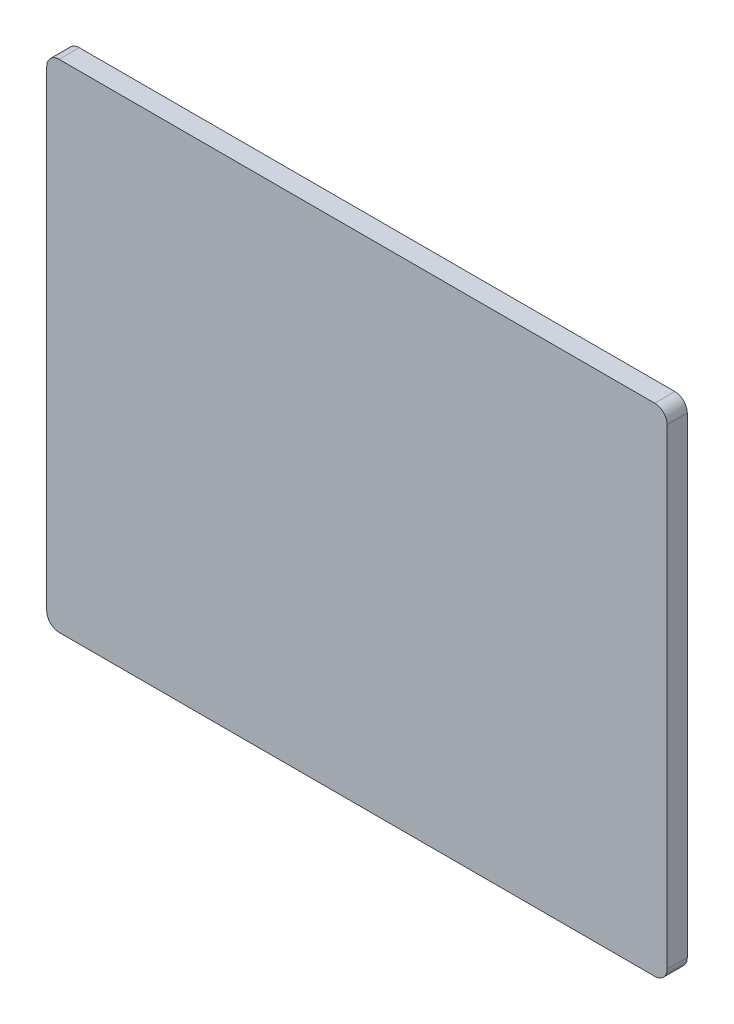
ISO-10303-21;
HEADER;
FILE_DESCRIPTION(('STEP AP214'),'2;1');
FILE_NAME('part.step','',(''),(''),'','','');
FILE_SCHEMA(('AUTOMOTIVE_DESIGN { 1 0 10303 214 1 1 1 1 }'));
ENDSEC;
DATA;
#1=APPLICATION_CONTEXT('core data for automotive mechanical design processes');
#2=APPLICATION_PROTOCOL_DEFINITION('international standard','automotive_design',2000,#1);
#3=PRODUCT_CONTEXT('',#1,'mechanical');
#4=PRODUCT('Part','Part','',(#3));
#5=PRODUCT_RELATED_PRODUCT_CATEGORY('part','',(#4));
#6=PRODUCT_DEFINITION_FORMATION('','',#4);
#7=PRODUCT_DEFINITION_CONTEXT('part definition',#1,'design');
#8=PRODUCT_DEFINITION('design','',#6,#7);
#9=PRODUCT_DEFINITION_SHAPE('','',#8);
#10=(LENGTH_UNIT() NAMED_UNIT(*) SI_UNIT(.MILLI.,.METRE.));
#11=(NAMED_UNIT(*) PLANE_ANGLE_UNIT() SI_UNIT($,.RADIAN.));
#12=(NAMED_UNIT(*) SI_UNIT($,.STERADIAN.) SOLID_ANGLE_UNIT());
#13=UNCERTAINTY_MEASURE_WITH_UNIT(LENGTH_MEASURE(1.E-05),#10,'distance_accuracy_value','');
#14=(GEOMETRIC_REPRESENTATION_CONTEXT(3) GLOBAL_UNCERTAINTY_ASSIGNED_CONTEXT((#13)) GLOBAL_UNIT_ASSIGNED_CONTEXT((#10,
#11,#12)) REPRESENTATION_CONTEXT('',''));
#15=CARTESIAN_POINT('',(0.,0.,0.));
#16=DIRECTION('',(0.,0.,1.));
#17=DIRECTION('',(1.,0.,0.));
#18=AXIS2_PLACEMENT_3D('',#15,#16,#17);
#19=CARTESIAN_POINT('',(0.,76.7324314895927,0.));
#20=DIRECTION('',(0.,-1.,0.));
#21=DIRECTION('',(0.,0.,-1.));
#22=AXIS2_PLACEMENT_3D('',#19,#20,#21);
#23=PLANE('',#22);
#24=DIRECTION('',(1.,0.,0.));
#25=VECTOR('',#24,1.);
#26=CARTESIAN_POINT('',(0.,76.7324314895927,13.));
#27=LINE('',#26,#25);
#28=CARTESIAN_POINT('',(-194.722973758673,76.7324314895927,13.));
#29=VERTEX_POINT('',#28);
#30=CARTESIAN_POINT('',(189.277026241327,76.7324314895927,13.));
#31=VERTEX_POINT('',#30);
#32=EDGE_CURVE('E162',#29,#31,#27,.T.);
#33=ORIENTED_EDGE('',*,*,#32,.T.);
#34=DIRECTION('',(0.,0.,1.));
#35=VECTOR('',#34,1.);
#36=CARTESIAN_POINT('',(189.277026241327,76.7324314895927,0.));
#37=LINE('',#36,#35);
#38=CARTESIAN_POINT('',(189.277026241327,76.7324314895927,0.));
#39=VERTEX_POINT('',#38);
#40=EDGE_CURVE('E142',#31,#39,#37,.F.);
#41=ORIENTED_EDGE('',*,*,#40,.T.);
#42=DIRECTION('',(1.,0.,0.));
#43=VECTOR('',#42,1.);
#44=CARTESIAN_POINT('',(0.,76.7324314895927,0.));
#45=LINE('',#44,#43);
#46=CARTESIAN_POINT('',(-194.722973758673,76.7324314895927,0.));
#47=VERTEX_POINT('',#46);
#48=EDGE_CURVE('E123',#47,#39,#45,.T.);
#49=ORIENTED_EDGE('',*,*,#48,.F.);
#50=DIRECTION('',(0.,0.,1.));
#51=VECTOR('',#50,1.);
#52=CARTESIAN_POINT('',(-194.722973758673,76.7324314895927,13.));
#53=LINE('',#52,#51);
#54=EDGE_CURVE('E139',#47,#29,#53,.T.);
#55=ORIENTED_EDGE('',*,*,#54,.T.);
#56=EDGE_LOOP('',(#33,#41,#49,#55));
#57=FACE_BOUND('',#56,.T.);
#58=ADVANCED_FACE('F37',(#57),#23,.F.);
#59=CARTESIAN_POINT('',(197.277026241327,0.,0.));
#60=DIRECTION('',(1.,0.,0.));
#61=DIRECTION('',(0.,1.,0.));
#62=AXIS2_PLACEMENT_3D('',#59,#60,#61);
#63=PLANE('',#62);
#64=DIRECTION('',(0.,1.,0.));
#65=VECTOR('',#64,1.);
#66=CARTESIAN_POINT('',(197.277026241327,0.,0.));
#67=LINE('',#66,#65);
#68=CARTESIAN_POINT('',(197.277026241327,-235.267568510407,0.));
#69=VERTEX_POINT('',#68);
#70=CARTESIAN_POINT('',(197.277026241327,68.7324314895926,0.));
#71=VERTEX_POINT('',#70);
#72=EDGE_CURVE('E127',#69,#71,#67,.T.);
#73=ORIENTED_EDGE('',*,*,#72,.T.);
#74=DIRECTION('',(0.,0.,1.));
#75=VECTOR('',#74,1.);
#76=CARTESIAN_POINT('',(197.277026241327,68.7324314895926,13.));
#77=LINE('',#76,#75);
#78=CARTESIAN_POINT('',(197.277026241327,68.7324314895926,13.));
#79=VERTEX_POINT('',#78);
#80=EDGE_CURVE('E114',#71,#79,#77,.T.);
#81=ORIENTED_EDGE('',*,*,#80,.T.);
#82=DIRECTION('',(0.,1.,0.));
#83=VECTOR('',#82,1.);
#84=CARTESIAN_POINT('',(197.277026241327,0.,13.));
#85=LINE('',#84,#83);
#86=CARTESIAN_POINT('',(197.277026241327,-235.267568510407,13.));
#87=VERTEX_POINT('',#86);
#88=EDGE_CURVE('E106',#87,#79,#85,.T.);
#89=ORIENTED_EDGE('',*,*,#88,.F.);
#90=DIRECTION('',(0.,0.,1.));
#91=VECTOR('',#90,1.);
#92=CARTESIAN_POINT('',(197.277026241327,-235.267568510407,0.));
#93=LINE('',#92,#91);
#94=EDGE_CURVE('E120',#87,#69,#93,.F.);
#95=ORIENTED_EDGE('',*,*,#94,.T.);
#96=EDGE_LOOP('',(#73,#81,#89,#95));
#97=FACE_BOUND('',#96,.T.);
#98=ADVANCED_FACE('F119',(#97),#63,.T.);
#99=CARTESIAN_POINT('',(0.,-243.267568510407,0.));
#100=DIRECTION('',(0.,-1.,0.));
#101=DIRECTION('',(0.,0.,-1.));
#102=AXIS2_PLACEMENT_3D('',#99,#100,#101);
#103=PLANE('',#102);
#104=DIRECTION('',(1.,0.,0.));
#105=VECTOR('',#104,1.);
#106=CARTESIAN_POINT('',(0.,-243.267568510407,13.));
#107=LINE('',#106,#105);
#108=CARTESIAN_POINT('',(-194.722973758673,-243.267568510407,13.));
#109=VERTEX_POINT('',#108);
#110=CARTESIAN_POINT('',(189.277026241327,-243.267568510407,13.));
#111=VERTEX_POINT('',#110);
#112=EDGE_CURVE('E108',#109,#111,#107,.T.);
#113=ORIENTED_EDGE('',*,*,#112,.F.);
#114=DIRECTION('',(0.,0.,1.));
#115=VECTOR('',#114,1.);
#116=CARTESIAN_POINT('',(-194.722973758673,-243.267568510407,0.));
#117=LINE('',#116,#115);
#118=CARTESIAN_POINT('',(-194.722973758673,-243.267568510407,0.));
#119=VERTEX_POINT('',#118);
#120=EDGE_CURVE('E11',#109,#119,#117,.F.);
#121=ORIENTED_EDGE('',*,*,#120,.T.);
#122=DIRECTION('',(1.,0.,0.));
#123=VECTOR('',#122,1.);
#124=CARTESIAN_POINT('',(0.,-243.267568510407,0.));
#125=LINE('',#124,#123);
#126=CARTESIAN_POINT('',(189.277026241327,-243.267568510407,0.));
#127=VERTEX_POINT('',#126);
#128=EDGE_CURVE('E130',#119,#127,#125,.T.);
#129=ORIENTED_EDGE('',*,*,#128,.T.);
#130=DIRECTION('',(0.,0.,1.));
#131=VECTOR('',#130,1.);
#132=CARTESIAN_POINT('',(189.277026241327,-243.267568510407,0.));
#133=LINE('',#132,#131);
#134=EDGE_CURVE('E45',#127,#111,#133,.T.);
#135=ORIENTED_EDGE('',*,*,#134,.T.);
#136=EDGE_LOOP('',(#113,#121,#129,#135));
#137=FACE_BOUND('',#136,.T.);
#138=ADVANCED_FACE('F155',(#137),#103,.T.);
#139=CARTESIAN_POINT('',(-202.722973758673,0.,0.));
#140=DIRECTION('',(-1.,0.,0.));
#141=DIRECTION('',(0.,-1.,0.));
#142=AXIS2_PLACEMENT_3D('',#139,#140,#141);
#143=PLANE('',#142);
#144=DIRECTION('',(0.,-1.,0.));
#145=VECTOR('',#144,1.);
#146=CARTESIAN_POINT('',(-202.722973758673,0.,13.));
#147=LINE('',#146,#145);
#148=CARTESIAN_POINT('',(-202.722973758673,68.7324314895927,13.));
#149=VERTEX_POINT('',#148);
#150=CARTESIAN_POINT('',(-202.722973758673,-235.267568510407,13.));
#151=VERTEX_POINT('',#150);
#152=EDGE_CURVE('E165',#149,#151,#147,.T.);
#153=ORIENTED_EDGE('',*,*,#152,.F.);
#154=DIRECTION('',(0.,0.,1.));
#155=VECTOR('',#154,1.);
#156=CARTESIAN_POINT('',(-202.722973758673,68.7324314895927,0.));
#157=LINE('',#156,#155);
#158=CARTESIAN_POINT('',(-202.722973758673,68.7324314895927,0.));
#159=VERTEX_POINT('',#158);
#160=EDGE_CURVE('E59',#149,#159,#157,.F.);
#161=ORIENTED_EDGE('',*,*,#160,.T.);
#162=DIRECTION('',(0.,-1.,0.));
#163=VECTOR('',#162,1.);
#164=CARTESIAN_POINT('',(-202.722973758673,0.,0.));
#165=LINE('',#164,#163);
#166=CARTESIAN_POINT('',(-202.722973758673,-235.267568510407,0.));
#167=VERTEX_POINT('',#166);
#168=EDGE_CURVE('E157',#159,#167,#165,.T.);
#169=ORIENTED_EDGE('',*,*,#168,.T.);
#170=DIRECTION('',(0.,0.,1.));
#171=VECTOR('',#170,1.);
#172=CARTESIAN_POINT('',(-202.722973758673,-235.267568510407,0.));
#173=LINE('',#172,#171);
#174=EDGE_CURVE('E150',#167,#151,#173,.T.);
#175=ORIENTED_EDGE('',*,*,#174,.T.);
#176=EDGE_LOOP('',(#153,#161,#169,#175));
#177=FACE_BOUND('',#176,.T.);
#178=ADVANCED_FACE('F168',(#177),#143,.T.);
#179=CARTESIAN_POINT('',(0.,0.,0.));
#180=DIRECTION('',(0.,0.,1.));
#181=DIRECTION('',(1.,0.,0.));
#182=AXIS2_PLACEMENT_3D('',#179,#180,#181);
#183=PLANE('',#182);
#184=ORIENTED_EDGE('',*,*,#48,.T.);
#185=CARTESIAN_POINT('',(189.277026241327,68.7324314895926,0.));
#186=DIRECTION('',(0.,0.,1.));
#187=DIRECTION('',(1.,0.,0.));
#188=AXIS2_PLACEMENT_3D('',#185,#186,#187);
#189=CIRCLE('',#188,8.00000000000001);
#190=EDGE_CURVE('E148',#39,#71,#189,.F.);
#191=ORIENTED_EDGE('',*,*,#190,.T.);
#192=ORIENTED_EDGE('',*,*,#72,.F.);
#193=CARTESIAN_POINT('',(189.277026241327,-235.267568510407,0.));
#194=DIRECTION('',(0.,0.,1.));
#195=DIRECTION('',(1.,0.,0.));
#196=AXIS2_PLACEMENT_3D('',#193,#194,#195);
#197=CIRCLE('',#196,8.00000000000001);
#198=EDGE_CURVE('E126',#69,#127,#197,.F.);
#199=ORIENTED_EDGE('',*,*,#198,.T.);
#200=ORIENTED_EDGE('',*,*,#128,.F.);
#201=CARTESIAN_POINT('',(-194.722973758673,-235.267568510407,0.));
#202=DIRECTION('',(0.,0.,1.));
#203=DIRECTION('',(1.,0.,0.));
#204=AXIS2_PLACEMENT_3D('',#201,#202,#203);
#205=CIRCLE('',#204,8.00000000000001);
#206=EDGE_CURVE('E52',#119,#167,#205,.F.);
#207=ORIENTED_EDGE('',*,*,#206,.T.);
#208=ORIENTED_EDGE('',*,*,#168,.F.);
#209=CARTESIAN_POINT('',(-194.722973758673,68.7324314895927,0.));
#210=DIRECTION('',(0.,0.,1.));
#211=DIRECTION('',(1.,0.,0.));
#212=AXIS2_PLACEMENT_3D('',#209,#210,#211);
#213=CIRCLE('',#212,8.00000000000001);
#214=EDGE_CURVE('E146',#159,#47,#213,.F.);
#215=ORIENTED_EDGE('',*,*,#214,.T.);
#216=EDGE_LOOP('',(#184,#191,#192,#199,#200,#207,#208,#215));
#217=FACE_BOUND('',#216,.T.);
#218=ADVANCED_FACE('F176',(#217),#183,.F.);
#219=CARTESIAN_POINT('',(0.,0.,13.));
#220=DIRECTION('',(0.,0.,1.));
#221=DIRECTION('',(1.,0.,0.));
#222=AXIS2_PLACEMENT_3D('',#219,#220,#221);
#223=PLANE('',#222);
#224=ORIENTED_EDGE('',*,*,#88,.T.);
#225=CARTESIAN_POINT('',(189.277026241327,68.7324314895926,13.));
#226=DIRECTION('',(0.,0.,1.));
#227=DIRECTION('',(1.,0.,0.));
#228=AXIS2_PLACEMENT_3D('',#225,#226,#227);
#229=CIRCLE('',#228,8.00000000000001);
#230=EDGE_CURVE('E137',#79,#31,#229,.T.);
#231=ORIENTED_EDGE('',*,*,#230,.T.);
#232=ORIENTED_EDGE('',*,*,#32,.F.);
#233=CARTESIAN_POINT('',(-194.722973758673,68.7324314895927,13.));
#234=DIRECTION('',(0.,0.,1.));
#235=DIRECTION('',(1.,0.,0.));
#236=AXIS2_PLACEMENT_3D('',#233,#234,#235);
#237=CIRCLE('',#236,8.00000000000001);
#238=EDGE_CURVE('E135',#29,#149,#237,.T.);
#239=ORIENTED_EDGE('',*,*,#238,.T.);
#240=ORIENTED_EDGE('',*,*,#152,.T.);
#241=CARTESIAN_POINT('',(-194.722973758673,-235.267568510407,13.));
#242=DIRECTION('',(0.,0.,1.));
#243=DIRECTION('',(1.,0.,0.));
#244=AXIS2_PLACEMENT_3D('',#241,#242,#243);
#245=CIRCLE('',#244,8.00000000000001);
#246=EDGE_CURVE('E113',#151,#109,#245,.T.);
#247=ORIENTED_EDGE('',*,*,#246,.T.);
#248=ORIENTED_EDGE('',*,*,#112,.T.);
#249=CARTESIAN_POINT('',(189.277026241327,-235.267568510407,13.));
#250=DIRECTION('',(0.,0.,1.));
#251=DIRECTION('',(1.,0.,0.));
#252=AXIS2_PLACEMENT_3D('',#249,#250,#251);
#253=CIRCLE('',#252,8.00000000000001);
#254=EDGE_CURVE('E103',#111,#87,#253,.T.);
#255=ORIENTED_EDGE('',*,*,#254,.T.);
#256=EDGE_LOOP('',(#224,#231,#232,#239,#240,#247,#248,#255));
#257=FACE_BOUND('',#256,.T.);
#258=ADVANCED_FACE('F105',(#257),#223,.T.);
#259=CARTESIAN_POINT('',(189.277026241327,68.7324314895926,0.));
#260=DIRECTION('',(0.,0.,-1.));
#261=DIRECTION('',(-1.,0.,0.));
#262=AXIS2_PLACEMENT_3D('',#259,#260,#261);
#263=CYLINDRICAL_SURFACE('',#262,8.00000000000001);
#264=ORIENTED_EDGE('',*,*,#190,.F.);
#265=ORIENTED_EDGE('',*,*,#40,.F.);
#266=ORIENTED_EDGE('',*,*,#230,.F.);
#267=ORIENTED_EDGE('',*,*,#80,.F.);
#268=EDGE_LOOP('',(#264,#265,#266,#267));
#269=FACE_BOUND('',#268,.T.);
#270=ADVANCED_FACE('F181',(#269),#263,.T.);
#271=CARTESIAN_POINT('',(-194.722973758673,68.7324314895927,0.));
#272=DIRECTION('',(0.,0.,-1.));
#273=DIRECTION('',(-1.,0.,0.));
#274=AXIS2_PLACEMENT_3D('',#271,#272,#273);
#275=CYLINDRICAL_SURFACE('',#274,8.00000000000001);
#276=ORIENTED_EDGE('',*,*,#214,.F.);
#277=ORIENTED_EDGE('',*,*,#160,.F.);
#278=ORIENTED_EDGE('',*,*,#238,.F.);
#279=ORIENTED_EDGE('',*,*,#54,.F.);
#280=EDGE_LOOP('',(#276,#277,#278,#279));
#281=FACE_BOUND('',#280,.T.);
#282=ADVANCED_FACE('F172',(#281),#275,.T.);
#283=CARTESIAN_POINT('',(-194.722973758673,-235.267568510407,0.));
#284=DIRECTION('',(0.,0.,1.));
#285=DIRECTION('',(1.,0.,0.));
#286=AXIS2_PLACEMENT_3D('',#283,#284,#285);
#287=CYLINDRICAL_SURFACE('',#286,8.00000000000001);
#288=ORIENTED_EDGE('',*,*,#206,.F.);
#289=ORIENTED_EDGE('',*,*,#120,.F.);
#290=ORIENTED_EDGE('',*,*,#246,.F.);
#291=ORIENTED_EDGE('',*,*,#174,.F.);
#292=EDGE_LOOP('',(#288,#289,#290,#291));
#293=FACE_BOUND('',#292,.T.);
#294=ADVANCED_FACE('F188',(#293),#287,.T.);
#295=CARTESIAN_POINT('',(189.277026241327,-235.267568510407,0.));
#296=DIRECTION('',(0.,0.,1.));
#297=DIRECTION('',(1.,0.,0.));
#298=AXIS2_PLACEMENT_3D('',#295,#296,#297);
#299=CYLINDRICAL_SURFACE('',#298,8.00000000000001);
#300=ORIENTED_EDGE('',*,*,#198,.F.);
#301=ORIENTED_EDGE('',*,*,#94,.F.);
#302=ORIENTED_EDGE('',*,*,#254,.F.);
#303=ORIENTED_EDGE('',*,*,#134,.F.);
#304=EDGE_LOOP('',(#300,#301,#302,#303));
#305=FACE_BOUND('',#304,.T.);
#306=ADVANCED_FACE('F39',(#305),#299,.T.);
#307=CLOSED_SHELL('',(#58,#98,#138,#178,#218,#258,#270,#282,#294,#306));
#308=MANIFOLD_SOLID_BREP('B2',#307);
#309=ADVANCED_BREP_SHAPE_REPRESENTATION('',(#18,#308),#14);
#310=SHAPE_DEFINITION_REPRESENTATION(#9,#309);
ENDSEC;
END-ISO-10303-21;
